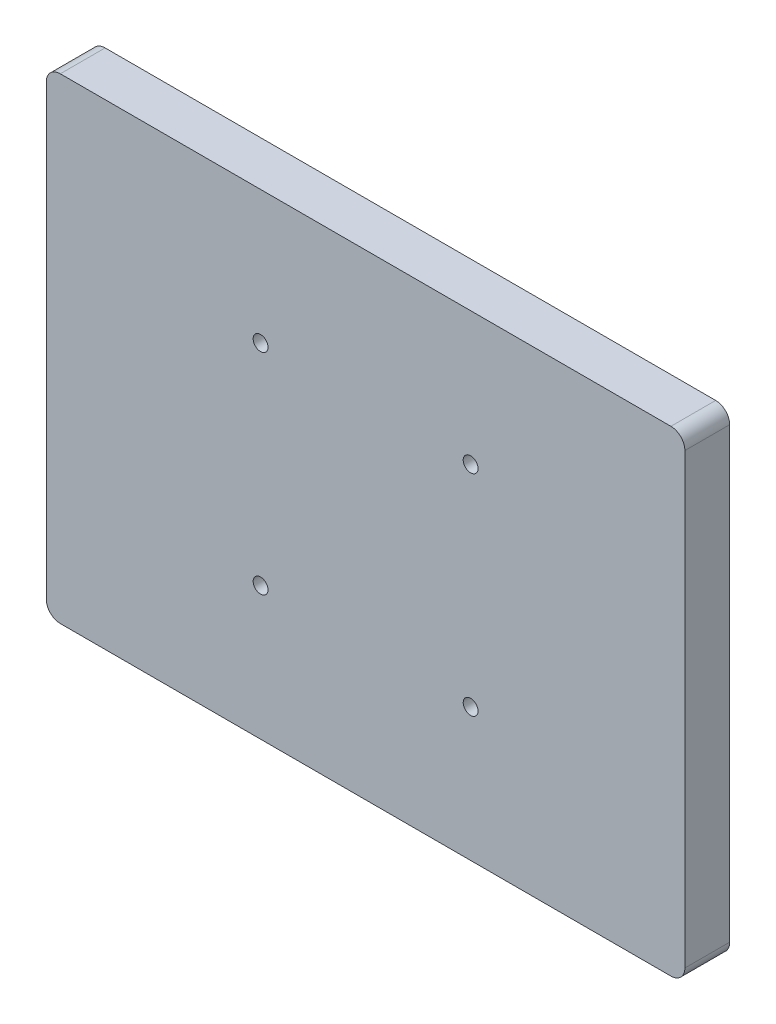
ISO-10303-21;
HEADER;
FILE_DESCRIPTION(('STEP AP214'),'2;1');
FILE_NAME('part.step','',(''),(''),'','','');
FILE_SCHEMA(('AUTOMOTIVE_DESIGN { 1 0 10303 214 1 1 1 1 }'));
ENDSEC;
DATA;
#1=APPLICATION_CONTEXT('core data for automotive mechanical design processes');
#2=APPLICATION_PROTOCOL_DEFINITION('international standard','automotive_design',2000,#1);
#3=PRODUCT_CONTEXT('',#1,'mechanical');
#4=PRODUCT('Part','Part','',(#3));
#5=PRODUCT_RELATED_PRODUCT_CATEGORY('part','',(#4));
#6=PRODUCT_DEFINITION_FORMATION('','',#4);
#7=PRODUCT_DEFINITION_CONTEXT('part definition',#1,'design');
#8=PRODUCT_DEFINITION('design','',#6,#7);
#9=PRODUCT_DEFINITION_SHAPE('','',#8);
#10=(LENGTH_UNIT() NAMED_UNIT(*) SI_UNIT(.MILLI.,.METRE.));
#11=(NAMED_UNIT(*) PLANE_ANGLE_UNIT() SI_UNIT($,.RADIAN.));
#12=(NAMED_UNIT(*) SI_UNIT($,.STERADIAN.) SOLID_ANGLE_UNIT());
#13=UNCERTAINTY_MEASURE_WITH_UNIT(LENGTH_MEASURE(1.E-05),#10,'distance_accuracy_value','');
#14=(GEOMETRIC_REPRESENTATION_CONTEXT(3) GLOBAL_UNCERTAINTY_ASSIGNED_CONTEXT((#13)) GLOBAL_UNIT_ASSIGNED_CONTEXT((#10,
#11,#12)) REPRESENTATION_CONTEXT('',''));
#15=CARTESIAN_POINT('',(0.,0.,0.));
#16=DIRECTION('',(0.,0.,1.));
#17=DIRECTION('',(1.,0.,0.));
#18=AXIS2_PLACEMENT_3D('',#15,#16,#17);
#19=CARTESIAN_POINT('',(0.,0.,16.));
#20=DIRECTION('',(1.,0.,0.));
#21=DIRECTION('',(0.,0.,-1.));
#22=AXIS2_PLACEMENT_3D('',#19,#20,#21);
#23=PLANE('',#22);
#24=DIRECTION('',(0.,-1.,0.));
#25=VECTOR('',#24,1.);
#26=CARTESIAN_POINT('',(0.,0.,0.));
#27=LINE('',#26,#25);
#28=CARTESIAN_POINT('',(0.,165.,0.));
#29=VERTEX_POINT('',#28);
#30=CARTESIAN_POINT('',(0.,5.,0.));
#31=VERTEX_POINT('',#30);
#32=EDGE_CURVE('E132',#29,#31,#27,.T.);
#33=ORIENTED_EDGE('',*,*,#32,.T.);
#34=DIRECTION('',(0.,0.,-1.));
#35=VECTOR('',#34,1.);
#36=CARTESIAN_POINT('',(0.,5.,16.));
#37=LINE('',#36,#35);
#38=CARTESIAN_POINT('',(0.,5.,16.));
#39=VERTEX_POINT('',#38);
#40=EDGE_CURVE('E154',#31,#39,#37,.F.);
#41=ORIENTED_EDGE('',*,*,#40,.T.);
#42=DIRECTION('',(0.,-1.,0.));
#43=VECTOR('',#42,1.);
#44=CARTESIAN_POINT('',(0.,0.,16.));
#45=LINE('',#44,#43);
#46=CARTESIAN_POINT('',(0.,165.,16.));
#47=VERTEX_POINT('',#46);
#48=EDGE_CURVE('E130',#47,#39,#45,.T.);
#49=ORIENTED_EDGE('',*,*,#48,.F.);
#50=DIRECTION('',(0.,0.,-1.));
#51=VECTOR('',#50,1.);
#52=CARTESIAN_POINT('',(0.,165.,16.));
#53=LINE('',#52,#51);
#54=EDGE_CURVE('E151',#47,#29,#53,.T.);
#55=ORIENTED_EDGE('',*,*,#54,.T.);
#56=EDGE_LOOP('',(#33,#41,#49,#55));
#57=FACE_BOUND('',#56,.T.);
#58=ADVANCED_FACE('F35',(#57),#23,.F.);
#59=CARTESIAN_POINT('',(0.,0.,16.));
#60=DIRECTION('',(0.,1.,0.));
#61=DIRECTION('',(0.,0.,1.));
#62=AXIS2_PLACEMENT_3D('',#59,#60,#61);
#63=PLANE('',#62);
#64=DIRECTION('',(1.,0.,0.));
#65=VECTOR('',#64,1.);
#66=CARTESIAN_POINT('',(0.,0.,0.));
#67=LINE('',#66,#65);
#68=CARTESIAN_POINT('',(5.,0.,0.));
#69=VERTEX_POINT('',#68);
#70=CARTESIAN_POINT('',(223.,0.,0.));
#71=VERTEX_POINT('',#70);
#72=EDGE_CURVE('E128',#69,#71,#67,.T.);
#73=ORIENTED_EDGE('',*,*,#72,.T.);
#74=DIRECTION('',(0.,0.,-1.));
#75=VECTOR('',#74,1.);
#76=CARTESIAN_POINT('',(223.,0.,16.));
#77=LINE('',#76,#75);
#78=CARTESIAN_POINT('',(223.,0.,16.));
#79=VERTEX_POINT('',#78);
#80=EDGE_CURVE('E106',#71,#79,#77,.F.);
#81=ORIENTED_EDGE('',*,*,#80,.T.);
#82=DIRECTION('',(1.,0.,0.));
#83=VECTOR('',#82,1.);
#84=CARTESIAN_POINT('',(0.,0.,16.));
#85=LINE('',#84,#83);
#86=CARTESIAN_POINT('',(5.,0.,16.));
#87=VERTEX_POINT('',#86);
#88=EDGE_CURVE('E168',#87,#79,#85,.T.);
#89=ORIENTED_EDGE('',*,*,#88,.F.);
#90=DIRECTION('',(0.,0.,-1.));
#91=VECTOR('',#90,1.);
#92=CARTESIAN_POINT('',(5.,0.,16.));
#93=LINE('',#92,#91);
#94=EDGE_CURVE('E111',#87,#69,#93,.T.);
#95=ORIENTED_EDGE('',*,*,#94,.T.);
#96=EDGE_LOOP('',(#73,#81,#89,#95));
#97=FACE_BOUND('',#96,.T.);
#98=ADVANCED_FACE('F173',(#97),#63,.F.);
#99=CARTESIAN_POINT('',(228.,0.,16.));
#100=DIRECTION('',(-1.,0.,0.));
#101=DIRECTION('',(0.,0.,1.));
#102=AXIS2_PLACEMENT_3D('',#99,#100,#101);
#103=PLANE('',#102);
#104=DIRECTION('',(0.,1.,0.));
#105=VECTOR('',#104,1.);
#106=CARTESIAN_POINT('',(228.,0.,16.));
#107=LINE('',#106,#105);
#108=CARTESIAN_POINT('',(228.,5.,16.));
#109=VERTEX_POINT('',#108);
#110=CARTESIAN_POINT('',(228.,165.,16.));
#111=VERTEX_POINT('',#110);
#112=EDGE_CURVE('E120',#109,#111,#107,.T.);
#113=ORIENTED_EDGE('',*,*,#112,.F.);
#114=DIRECTION('',(0.,0.,-1.));
#115=VECTOR('',#114,1.);
#116=CARTESIAN_POINT('',(228.,5.,16.));
#117=LINE('',#116,#115);
#118=CARTESIAN_POINT('',(228.,5.,0.));
#119=VERTEX_POINT('',#118);
#120=EDGE_CURVE('E105',#109,#119,#117,.T.);
#121=ORIENTED_EDGE('',*,*,#120,.T.);
#122=DIRECTION('',(0.,1.,0.));
#123=VECTOR('',#122,1.);
#124=CARTESIAN_POINT('',(228.,0.,0.));
#125=LINE('',#124,#123);
#126=CARTESIAN_POINT('',(228.,165.,0.));
#127=VERTEX_POINT('',#126);
#128=EDGE_CURVE('E118',#119,#127,#125,.T.);
#129=ORIENTED_EDGE('',*,*,#128,.T.);
#130=DIRECTION('',(0.,0.,-1.));
#131=VECTOR('',#130,1.);
#132=CARTESIAN_POINT('',(228.,165.,16.));
#133=LINE('',#132,#131);
#134=EDGE_CURVE('E122',#127,#111,#133,.F.);
#135=ORIENTED_EDGE('',*,*,#134,.T.);
#136=EDGE_LOOP('',(#113,#121,#129,#135));
#137=FACE_BOUND('',#136,.T.);
#138=ADVANCED_FACE('F117',(#137),#103,.F.);
#139=CARTESIAN_POINT('',(0.,170.,16.));
#140=DIRECTION('',(0.,-1.,0.));
#141=DIRECTION('',(0.,0.,-1.));
#142=AXIS2_PLACEMENT_3D('',#139,#140,#141);
#143=PLANE('',#142);
#144=DIRECTION('',(-1.,0.,0.));
#145=VECTOR('',#144,1.);
#146=CARTESIAN_POINT('',(0.,170.,16.));
#147=LINE('',#146,#145);
#148=CARTESIAN_POINT('',(223.,170.,16.));
#149=VERTEX_POINT('',#148);
#150=CARTESIAN_POINT('',(5.,170.,16.));
#151=VERTEX_POINT('',#150);
#152=EDGE_CURVE('E136',#149,#151,#147,.T.);
#153=ORIENTED_EDGE('',*,*,#152,.F.);
#154=DIRECTION('',(0.,0.,-1.));
#155=VECTOR('',#154,1.);
#156=CARTESIAN_POINT('',(223.,170.,16.));
#157=LINE('',#156,#155);
#158=CARTESIAN_POINT('',(223.,170.,0.));
#159=VERTEX_POINT('',#158);
#160=EDGE_CURVE('E11',#149,#159,#157,.T.);
#161=ORIENTED_EDGE('',*,*,#160,.T.);
#162=DIRECTION('',(-1.,0.,0.));
#163=VECTOR('',#162,1.);
#164=CARTESIAN_POINT('',(0.,170.,0.));
#165=LINE('',#164,#163);
#166=CARTESIAN_POINT('',(5.,170.,0.));
#167=VERTEX_POINT('',#166);
#168=EDGE_CURVE('E127',#159,#167,#165,.T.);
#169=ORIENTED_EDGE('',*,*,#168,.T.);
#170=DIRECTION('',(0.,0.,-1.));
#171=VECTOR('',#170,1.);
#172=CARTESIAN_POINT('',(5.,170.,16.));
#173=LINE('',#172,#171);
#174=EDGE_CURVE('E43',#167,#151,#173,.F.);
#175=ORIENTED_EDGE('',*,*,#174,.T.);
#176=EDGE_LOOP('',(#153,#161,#169,#175));
#177=FACE_BOUND('',#176,.T.);
#178=ADVANCED_FACE('F207',(#177),#143,.F.);
#179=CARTESIAN_POINT('',(0.,0.,16.));
#180=DIRECTION('',(0.,0.,-1.));
#181=DIRECTION('',(-1.,0.,0.));
#182=AXIS2_PLACEMENT_3D('',#179,#180,#181);
#183=PLANE('',#182);
#184=CARTESIAN_POINT('',(151.5,122.5,16.));
#185=DIRECTION('',(0.,0.,1.));
#186=DIRECTION('',(-1.,0.,0.));
#187=AXIS2_PLACEMENT_3D('',#184,#185,#186);
#188=CIRCLE('',#187,2.65000000000001);
#189=CARTESIAN_POINT('',(148.85,122.5,16.));
#190=VERTEX_POINT('',#189);
#191=EDGE_CURVE('E183',#190,#190,#188,.T.);
#192=ORIENTED_EDGE('',*,*,#191,.F.);
#193=EDGE_LOOP('',(#192));
#194=FACE_BOUND('',#193,.T.);
#195=CARTESIAN_POINT('',(76.5,47.5,16.));
#196=DIRECTION('',(0.,0.,1.));
#197=DIRECTION('',(-1.,0.,0.));
#198=AXIS2_PLACEMENT_3D('',#195,#196,#197);
#199=CIRCLE('',#198,2.65);
#200=CARTESIAN_POINT('',(73.85,47.5,16.));
#201=VERTEX_POINT('',#200);
#202=EDGE_CURVE('E188',#201,#201,#199,.T.);
#203=ORIENTED_EDGE('',*,*,#202,.F.);
#204=EDGE_LOOP('',(#203));
#205=FACE_BOUND('',#204,.T.);
#206=CARTESIAN_POINT('',(151.5,47.5,16.));
#207=DIRECTION('',(0.,0.,1.));
#208=DIRECTION('',(1.,0.,0.));
#209=AXIS2_PLACEMENT_3D('',#206,#207,#208);
#210=CIRCLE('',#209,2.65000000000002);
#211=CARTESIAN_POINT('',(154.15,47.5,16.));
#212=VERTEX_POINT('',#211);
#213=EDGE_CURVE('E189',#212,#212,#210,.T.);
#214=ORIENTED_EDGE('',*,*,#213,.F.);
#215=EDGE_LOOP('',(#214));
#216=FACE_BOUND('',#215,.T.);
#217=CARTESIAN_POINT('',(76.5,122.5,16.));
#218=DIRECTION('',(0.,0.,1.));
#219=DIRECTION('',(1.,0.,0.));
#220=AXIS2_PLACEMENT_3D('',#217,#218,#219);
#221=CIRCLE('',#220,2.65);
#222=CARTESIAN_POINT('',(79.15,122.5,16.));
#223=VERTEX_POINT('',#222);
#224=EDGE_CURVE('E174',#223,#223,#221,.T.);
#225=ORIENTED_EDGE('',*,*,#224,.F.);
#226=EDGE_LOOP('',(#225));
#227=FACE_BOUND('',#226,.T.);
#228=ORIENTED_EDGE('',*,*,#88,.T.);
#229=CARTESIAN_POINT('',(223.,5.,16.));
#230=DIRECTION('',(0.,0.,-1.));
#231=DIRECTION('',(-1.,0.,0.));
#232=AXIS2_PLACEMENT_3D('',#229,#230,#231);
#233=CIRCLE('',#232,5.);
#234=EDGE_CURVE('E149',#79,#109,#233,.F.);
#235=ORIENTED_EDGE('',*,*,#234,.T.);
#236=ORIENTED_EDGE('',*,*,#112,.T.);
#237=CARTESIAN_POINT('',(223.,165.,16.));
#238=DIRECTION('',(0.,0.,-1.));
#239=DIRECTION('',(-1.,0.,0.));
#240=AXIS2_PLACEMENT_3D('',#237,#238,#239);
#241=CIRCLE('',#240,5.);
#242=EDGE_CURVE('E56',#111,#149,#241,.F.);
#243=ORIENTED_EDGE('',*,*,#242,.T.);
#244=ORIENTED_EDGE('',*,*,#152,.T.);
#245=CARTESIAN_POINT('',(5.,165.,16.));
#246=DIRECTION('',(0.,0.,-1.));
#247=DIRECTION('',(-1.,0.,0.));
#248=AXIS2_PLACEMENT_3D('',#245,#246,#247);
#249=CIRCLE('',#248,5.);
#250=EDGE_CURVE('E144',#151,#47,#249,.F.);
#251=ORIENTED_EDGE('',*,*,#250,.T.);
#252=ORIENTED_EDGE('',*,*,#48,.T.);
#253=CARTESIAN_POINT('',(5.,5.,16.));
#254=DIRECTION('',(0.,0.,-1.));
#255=DIRECTION('',(-1.,0.,0.));
#256=AXIS2_PLACEMENT_3D('',#253,#254,#255);
#257=CIRCLE('',#256,5.);
#258=EDGE_CURVE('E147',#39,#87,#257,.F.);
#259=ORIENTED_EDGE('',*,*,#258,.T.);
#260=EDGE_LOOP('',(#228,#235,#236,#243,#244,#251,#252,#259));
#261=FACE_BOUND('',#260,.T.);
#262=ADVANCED_FACE('F165',(#194,#205,#216,#227,#261),#183,.F.);
#263=CARTESIAN_POINT('',(0.,0.,0.));
#264=DIRECTION('',(0.,0.,-1.));
#265=DIRECTION('',(-1.,0.,0.));
#266=AXIS2_PLACEMENT_3D('',#263,#264,#265);
#267=PLANE('',#266);
#268=CARTESIAN_POINT('',(151.5,122.5,0.));
#269=DIRECTION('',(0.,0.,-1.));
#270=DIRECTION('',(-1.,0.,0.));
#271=AXIS2_PLACEMENT_3D('',#268,#269,#270);
#272=CIRCLE('',#271,2.65000000000001);
#273=CARTESIAN_POINT('',(148.85,122.5,0.));
#274=VERTEX_POINT('',#273);
#275=EDGE_CURVE('E192',#274,#274,#272,.F.);
#276=ORIENTED_EDGE('',*,*,#275,.T.);
#277=EDGE_LOOP('',(#276));
#278=FACE_BOUND('',#277,.T.);
#279=CARTESIAN_POINT('',(76.5,47.5,0.));
#280=DIRECTION('',(0.,0.,-1.));
#281=DIRECTION('',(-1.,0.,0.));
#282=AXIS2_PLACEMENT_3D('',#279,#280,#281);
#283=CIRCLE('',#282,2.65);
#284=CARTESIAN_POINT('',(73.85,47.5,0.));
#285=VERTEX_POINT('',#284);
#286=EDGE_CURVE('E185',#285,#285,#283,.F.);
#287=ORIENTED_EDGE('',*,*,#286,.T.);
#288=EDGE_LOOP('',(#287));
#289=FACE_BOUND('',#288,.T.);
#290=CARTESIAN_POINT('',(151.5,47.5,0.));
#291=DIRECTION('',(0.,0.,-1.));
#292=DIRECTION('',(-1.,0.,0.));
#293=AXIS2_PLACEMENT_3D('',#290,#291,#292);
#294=CIRCLE('',#293,2.65000000000002);
#295=CARTESIAN_POINT('',(148.85,47.5,0.));
#296=VERTEX_POINT('',#295);
#297=EDGE_CURVE('E197',#296,#296,#294,.F.);
#298=ORIENTED_EDGE('',*,*,#297,.T.);
#299=EDGE_LOOP('',(#298));
#300=FACE_BOUND('',#299,.T.);
#301=CARTESIAN_POINT('',(76.5,122.5,0.));
#302=DIRECTION('',(0.,0.,-1.));
#303=DIRECTION('',(-1.,0.,0.));
#304=AXIS2_PLACEMENT_3D('',#301,#302,#303);
#305=CIRCLE('',#304,2.65);
#306=CARTESIAN_POINT('',(73.85,122.5,0.));
#307=VERTEX_POINT('',#306);
#308=EDGE_CURVE('E176',#307,#307,#305,.F.);
#309=ORIENTED_EDGE('',*,*,#308,.T.);
#310=EDGE_LOOP('',(#309));
#311=FACE_BOUND('',#310,.T.);
#312=ORIENTED_EDGE('',*,*,#128,.F.);
#313=CARTESIAN_POINT('',(223.,5.,0.));
#314=DIRECTION('',(0.,0.,-1.));
#315=DIRECTION('',(-1.,0.,0.));
#316=AXIS2_PLACEMENT_3D('',#313,#314,#315);
#317=CIRCLE('',#316,5.);
#318=EDGE_CURVE('E101',#119,#71,#317,.T.);
#319=ORIENTED_EDGE('',*,*,#318,.T.);
#320=ORIENTED_EDGE('',*,*,#72,.F.);
#321=CARTESIAN_POINT('',(5.,5.,0.));
#322=DIRECTION('',(0.,0.,-1.));
#323=DIRECTION('',(-1.,0.,0.));
#324=AXIS2_PLACEMENT_3D('',#321,#322,#323);
#325=CIRCLE('',#324,5.);
#326=EDGE_CURVE('E112',#69,#31,#325,.T.);
#327=ORIENTED_EDGE('',*,*,#326,.T.);
#328=ORIENTED_EDGE('',*,*,#32,.F.);
#329=CARTESIAN_POINT('',(5.,165.,0.));
#330=DIRECTION('',(0.,0.,-1.));
#331=DIRECTION('',(-1.,0.,0.));
#332=AXIS2_PLACEMENT_3D('',#329,#330,#331);
#333=CIRCLE('',#332,5.);
#334=EDGE_CURVE('E121',#29,#167,#333,.T.);
#335=ORIENTED_EDGE('',*,*,#334,.T.);
#336=ORIENTED_EDGE('',*,*,#168,.F.);
#337=CARTESIAN_POINT('',(223.,165.,0.));
#338=DIRECTION('',(0.,0.,-1.));
#339=DIRECTION('',(-1.,0.,0.));
#340=AXIS2_PLACEMENT_3D('',#337,#338,#339);
#341=CIRCLE('',#340,5.);
#342=EDGE_CURVE('E126',#159,#127,#341,.T.);
#343=ORIENTED_EDGE('',*,*,#342,.T.);
#344=EDGE_LOOP('',(#312,#319,#320,#327,#328,#335,#336,#343));
#345=FACE_BOUND('',#344,.T.);
#346=ADVANCED_FACE('F124',(#278,#289,#300,#311,#345),#267,.T.);
#347=CARTESIAN_POINT('',(223.,5.,16.));
#348=DIRECTION('',(0.,0.,-1.));
#349=DIRECTION('',(-1.,0.,0.));
#350=AXIS2_PLACEMENT_3D('',#347,#348,#349);
#351=CYLINDRICAL_SURFACE('',#350,5.);
#352=ORIENTED_EDGE('',*,*,#234,.F.);
#353=ORIENTED_EDGE('',*,*,#80,.F.);
#354=ORIENTED_EDGE('',*,*,#318,.F.);
#355=ORIENTED_EDGE('',*,*,#120,.F.);
#356=EDGE_LOOP('',(#352,#353,#354,#355));
#357=FACE_BOUND('',#356,.T.);
#358=ADVANCED_FACE('F104',(#357),#351,.T.);
#359=CARTESIAN_POINT('',(5.,5.,16.));
#360=DIRECTION('',(0.,0.,-1.));
#361=DIRECTION('',(-1.,0.,0.));
#362=AXIS2_PLACEMENT_3D('',#359,#360,#361);
#363=CYLINDRICAL_SURFACE('',#362,5.);
#364=ORIENTED_EDGE('',*,*,#258,.F.);
#365=ORIENTED_EDGE('',*,*,#40,.F.);
#366=ORIENTED_EDGE('',*,*,#326,.F.);
#367=ORIENTED_EDGE('',*,*,#94,.F.);
#368=EDGE_LOOP('',(#364,#365,#366,#367));
#369=FACE_BOUND('',#368,.T.);
#370=ADVANCED_FACE('F171',(#369),#363,.T.);
#371=CARTESIAN_POINT('',(223.,165.,16.));
#372=DIRECTION('',(0.,0.,-1.));
#373=DIRECTION('',(-1.,0.,0.));
#374=AXIS2_PLACEMENT_3D('',#371,#372,#373);
#375=CYLINDRICAL_SURFACE('',#374,5.);
#376=ORIENTED_EDGE('',*,*,#242,.F.);
#377=ORIENTED_EDGE('',*,*,#134,.F.);
#378=ORIENTED_EDGE('',*,*,#342,.F.);
#379=ORIENTED_EDGE('',*,*,#160,.F.);
#380=EDGE_LOOP('',(#376,#377,#378,#379));
#381=FACE_BOUND('',#380,.T.);
#382=ADVANCED_FACE('F223',(#381),#375,.T.);
#383=CARTESIAN_POINT('',(5.,165.,16.));
#384=DIRECTION('',(0.,0.,-1.));
#385=DIRECTION('',(-1.,0.,0.));
#386=AXIS2_PLACEMENT_3D('',#383,#384,#385);
#387=CYLINDRICAL_SURFACE('',#386,5.);
#388=ORIENTED_EDGE('',*,*,#250,.F.);
#389=ORIENTED_EDGE('',*,*,#174,.F.);
#390=ORIENTED_EDGE('',*,*,#334,.F.);
#391=ORIENTED_EDGE('',*,*,#54,.F.);
#392=EDGE_LOOP('',(#388,#389,#390,#391));
#393=FACE_BOUND('',#392,.T.);
#394=ADVANCED_FACE('F37',(#393),#387,.T.);
#395=CARTESIAN_POINT('',(76.5,122.5,-0.001000000000001));
#396=DIRECTION('',(0.,0.,1.));
#397=DIRECTION('',(1.,0.,0.));
#398=AXIS2_PLACEMENT_3D('',#395,#396,#397);
#399=CYLINDRICAL_SURFACE('',#398,2.65);
#400=ORIENTED_EDGE('',*,*,#308,.F.);
#401=EDGE_LOOP('',(#400));
#402=FACE_BOUND('',#401,.T.);
#403=ORIENTED_EDGE('',*,*,#224,.T.);
#404=EDGE_LOOP('',(#403));
#405=FACE_BOUND('',#404,.T.);
#406=ADVANCED_FACE('F212',(#402,#405),#399,.F.);
#407=CARTESIAN_POINT('',(151.5,47.5,-0.001000000000001));
#408=DIRECTION('',(0.,0.,1.));
#409=DIRECTION('',(1.,0.,0.));
#410=AXIS2_PLACEMENT_3D('',#407,#408,#409);
#411=CYLINDRICAL_SURFACE('',#410,2.65000000000002);
#412=ORIENTED_EDGE('',*,*,#297,.F.);
#413=EDGE_LOOP('',(#412));
#414=FACE_BOUND('',#413,.T.);
#415=ORIENTED_EDGE('',*,*,#213,.T.);
#416=EDGE_LOOP('',(#415));
#417=FACE_BOUND('',#416,.T.);
#418=ADVANCED_FACE('F203',(#414,#417),#411,.F.);
#419=CARTESIAN_POINT('',(76.5,47.5,-0.001000000000001));
#420=DIRECTION('',(0.,0.,1.));
#421=DIRECTION('',(1.,0.,0.));
#422=AXIS2_PLACEMENT_3D('',#419,#420,#421);
#423=CYLINDRICAL_SURFACE('',#422,2.65);
#424=ORIENTED_EDGE('',*,*,#286,.F.);
#425=EDGE_LOOP('',(#424));
#426=FACE_BOUND('',#425,.T.);
#427=ORIENTED_EDGE('',*,*,#202,.T.);
#428=EDGE_LOOP('',(#427));
#429=FACE_BOUND('',#428,.T.);
#430=ADVANCED_FACE('F220',(#426,#429),#423,.F.);
#431=CARTESIAN_POINT('',(151.5,122.5,-0.001000000000001));
#432=DIRECTION('',(0.,0.,1.));
#433=DIRECTION('',(1.,0.,0.));
#434=AXIS2_PLACEMENT_3D('',#431,#432,#433);
#435=CYLINDRICAL_SURFACE('',#434,2.65000000000001);
#436=ORIENTED_EDGE('',*,*,#275,.F.);
#437=EDGE_LOOP('',(#436));
#438=FACE_BOUND('',#437,.T.);
#439=ORIENTED_EDGE('',*,*,#191,.T.);
#440=EDGE_LOOP('',(#439));
#441=FACE_BOUND('',#440,.T.);
#442=ADVANCED_FACE('F263',(#438,#441),#435,.F.);
#443=CLOSED_SHELL('',(#58,#98,#138,#178,#262,#346,#358,#370,#382,#394,#406,#418,#430,#442));
#444=MANIFOLD_SOLID_BREP('B2',#443);
#445=ADVANCED_BREP_SHAPE_REPRESENTATION('',(#18,#444),#14);
#446=SHAPE_DEFINITION_REPRESENTATION(#9,#445);
ENDSEC;
END-ISO-10303-21;
